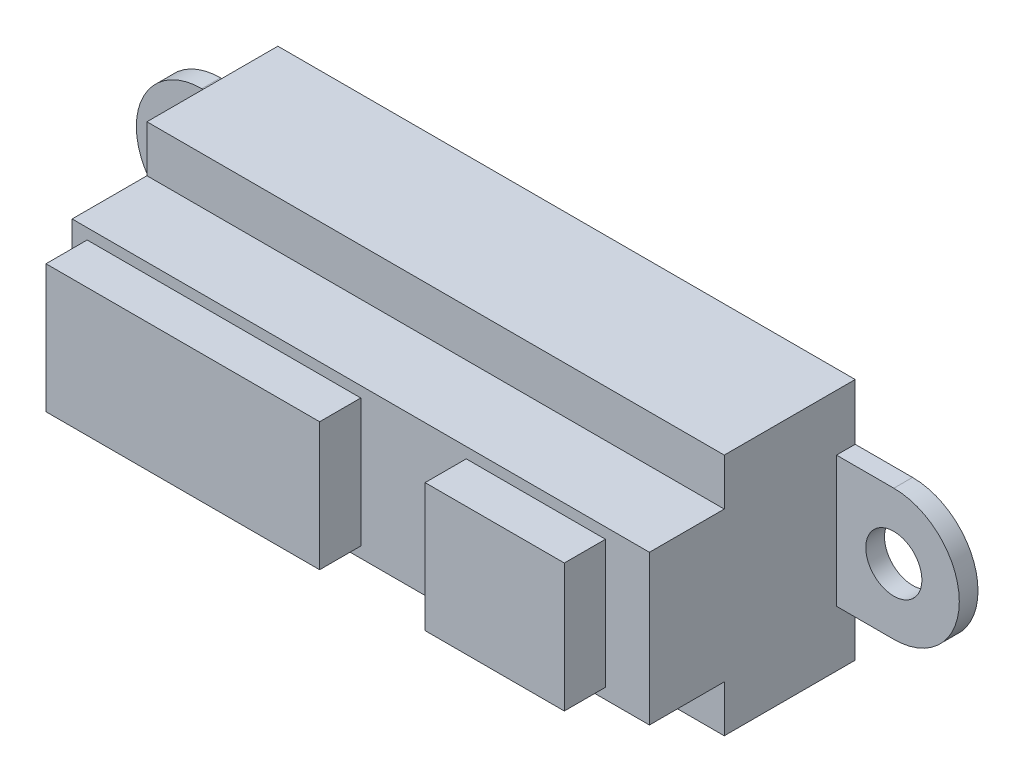
ISO-10303-21;
HEADER;
FILE_DESCRIPTION(('STEP AP214'),'2;1');
FILE_NAME('part.step','',(''),(''),'','','');
FILE_SCHEMA(('AUTOMOTIVE_DESIGN { 1 0 10303 214 1 1 1 1 }'));
ENDSEC;
DATA;
#1=APPLICATION_CONTEXT('core data for automotive mechanical design processes');
#2=APPLICATION_PROTOCOL_DEFINITION('international standard','automotive_design',2000,#1);
#3=PRODUCT_CONTEXT('',#1,'mechanical');
#4=PRODUCT('Part','Part','',(#3));
#5=PRODUCT_RELATED_PRODUCT_CATEGORY('part','',(#4));
#6=PRODUCT_DEFINITION_FORMATION('','',#4);
#7=PRODUCT_DEFINITION_CONTEXT('part definition',#1,'design');
#8=PRODUCT_DEFINITION('design','',#6,#7);
#9=PRODUCT_DEFINITION_SHAPE('','',#8);
#10=(LENGTH_UNIT() NAMED_UNIT(*) SI_UNIT(.MILLI.,.METRE.));
#11=(NAMED_UNIT(*) PLANE_ANGLE_UNIT() SI_UNIT($,.RADIAN.));
#12=(NAMED_UNIT(*) SI_UNIT($,.STERADIAN.) SOLID_ANGLE_UNIT());
#13=UNCERTAINTY_MEASURE_WITH_UNIT(LENGTH_MEASURE(1.E-05),#10,'distance_accuracy_value','');
#14=(GEOMETRIC_REPRESENTATION_CONTEXT(3) GLOBAL_UNCERTAINTY_ASSIGNED_CONTEXT((#13)) GLOBAL_UNIT_ASSIGNED_CONTEXT((#10,
#11,#12)) REPRESENTATION_CONTEXT('',''));
#15=CARTESIAN_POINT('',(0.,0.,0.));
#16=DIRECTION('',(0.,0.,1.));
#17=DIRECTION('',(1.,0.,0.));
#18=AXIS2_PLACEMENT_3D('',#15,#16,#17);
#19=CARTESIAN_POINT('',(0.,0.,11.));
#20=DIRECTION('',(0.,0.,1.));
#21=DIRECTION('',(1.,0.,0.));
#22=AXIS2_PLACEMENT_3D('',#19,#20,#21);
#23=PLANE('',#22);
#24=DIRECTION('',(0.,-1.,0.));
#25=VECTOR('',#24,1.);
#26=CARTESIAN_POINT('',(-15.4334998563258,4.,11.));
#27=LINE('',#26,#25);
#28=CARTESIAN_POINT('',(-15.4334998563258,4.,11.));
#29=VERTEX_POINT('',#28);
#30=CARTESIAN_POINT('',(-15.4334998563258,-4.,11.));
#31=VERTEX_POINT('',#30);
#32=EDGE_CURVE('E289',#29,#31,#27,.T.);
#33=ORIENTED_EDGE('',*,*,#32,.T.);
#34=DIRECTION('',(1.,0.,0.));
#35=VECTOR('',#34,1.);
#36=CARTESIAN_POINT('',(-15.4334998563258,-4.,11.));
#37=LINE('',#36,#35);
#38=CARTESIAN_POINT('',(15.4334998563258,-4.,11.));
#39=VERTEX_POINT('',#38);
#40=EDGE_CURVE('E292',#31,#39,#37,.T.);
#41=ORIENTED_EDGE('',*,*,#40,.T.);
#42=DIRECTION('',(0.,1.,0.));
#43=VECTOR('',#42,1.);
#44=CARTESIAN_POINT('',(15.4334998563258,4.,11.));
#45=LINE('',#44,#43);
#46=CARTESIAN_POINT('',(15.4334998563258,4.,11.));
#47=VERTEX_POINT('',#46);
#48=EDGE_CURVE('E294',#39,#47,#45,.T.);
#49=ORIENTED_EDGE('',*,*,#48,.T.);
#50=DIRECTION('',(-1.,0.,0.));
#51=VECTOR('',#50,1.);
#52=CARTESIAN_POINT('',(-15.4334998563258,4.,11.));
#53=LINE('',#52,#51);
#54=EDGE_CURVE('E296',#47,#29,#53,.T.);
#55=ORIENTED_EDGE('',*,*,#54,.T.);
#56=EDGE_LOOP('',(#33,#41,#49,#55));
#57=FACE_BOUND('',#56,.T.);
#58=DIRECTION('',(-1.,0.,0.));
#59=VECTOR('',#58,1.);
#60=CARTESIAN_POINT('',(0.,-3.42720985348212,11.));
#61=LINE('',#60,#59);
#62=CARTESIAN_POINT('',(0.,-3.42720985348212,11.));
#63=VERTEX_POINT('',#62);
#64=CARTESIAN_POINT('',(-14.6301323852945,-3.42720985348212,11.));
#65=VERTEX_POINT('',#64);
#66=EDGE_CURVE('E43',#63,#65,#61,.T.);
#67=ORIENTED_EDGE('',*,*,#66,.T.);
#68=DIRECTION('',(0.,1.,0.));
#69=VECTOR('',#68,1.);
#70=CARTESIAN_POINT('',(-14.6301323852945,0.,11.));
#71=LINE('',#70,#69);
#72=CARTESIAN_POINT('',(-14.6301323852945,3.42720985348204,11.));
#73=VERTEX_POINT('',#72);
#74=EDGE_CURVE('E11',#65,#73,#71,.T.);
#75=ORIENTED_EDGE('',*,*,#74,.T.);
#76=DIRECTION('',(1.,0.,0.));
#77=VECTOR('',#76,1.);
#78=CARTESIAN_POINT('',(0.,3.42720985348204,11.));
#79=LINE('',#78,#77);
#80=CARTESIAN_POINT('',(0.,3.42720985348204,11.));
#81=VERTEX_POINT('',#80);
#82=EDGE_CURVE('E377',#73,#81,#79,.T.);
#83=ORIENTED_EDGE('',*,*,#82,.T.);
#84=DIRECTION('',(0.,-1.,0.));
#85=VECTOR('',#84,1.);
#86=CARTESIAN_POINT('',(0.,0.,11.));
#87=LINE('',#86,#85);
#88=EDGE_CURVE('E380',#81,#63,#87,.T.);
#89=ORIENTED_EDGE('',*,*,#88,.T.);
#90=EDGE_LOOP('',(#67,#75,#83,#89));
#91=FACE_BOUND('',#90,.T.);
#92=DIRECTION('',(-1.,0.,0.));
#93=VECTOR('',#92,1.);
#94=CARTESIAN_POINT('',(0.,-3.42720985348212,11.));
#95=LINE('',#94,#93);
#96=CARTESIAN_POINT('',(13.0823601933993,-3.42720985348212,11.));
#97=VERTEX_POINT('',#96);
#98=CARTESIAN_POINT('',(5.63831298476084,-3.42720985348212,11.));
#99=VERTEX_POINT('',#98);
#100=EDGE_CURVE('E264',#97,#99,#95,.T.);
#101=ORIENTED_EDGE('',*,*,#100,.T.);
#102=DIRECTION('',(0.,1.,0.));
#103=VECTOR('',#102,1.);
#104=CARTESIAN_POINT('',(5.63831298476084,0.,11.));
#105=LINE('',#104,#103);
#106=CARTESIAN_POINT('',(5.63831298476084,3.42720985348204,11.));
#107=VERTEX_POINT('',#106);
#108=EDGE_CURVE('E267',#99,#107,#105,.T.);
#109=ORIENTED_EDGE('',*,*,#108,.T.);
#110=DIRECTION('',(1.,0.,0.));
#111=VECTOR('',#110,1.);
#112=CARTESIAN_POINT('',(0.,3.42720985348204,11.));
#113=LINE('',#112,#111);
#114=CARTESIAN_POINT('',(13.0823601933993,3.42720985348204,11.));
#115=VERTEX_POINT('',#114);
#116=EDGE_CURVE('E258',#107,#115,#113,.T.);
#117=ORIENTED_EDGE('',*,*,#116,.T.);
#118=DIRECTION('',(0.,-1.,0.));
#119=VECTOR('',#118,1.);
#120=CARTESIAN_POINT('',(13.0823601933993,0.,11.));
#121=LINE('',#120,#119);
#122=EDGE_CURVE('E261',#115,#97,#121,.T.);
#123=ORIENTED_EDGE('',*,*,#122,.T.);
#124=EDGE_LOOP('',(#101,#109,#117,#123));
#125=FACE_BOUND('',#124,.T.);
#126=ADVANCED_FACE('F34',(#57,#91,#125),#23,.T.);
#127=CARTESIAN_POINT('',(0.,0.,7.));
#128=DIRECTION('',(0.,0.,-1.));
#129=DIRECTION('',(-1.,0.,0.));
#130=AXIS2_PLACEMENT_3D('',#127,#128,#129);
#131=PLANE('',#130);
#132=DIRECTION('',(1.,0.,0.));
#133=VECTOR('',#132,1.);
#134=CARTESIAN_POINT('',(0.,-4.,7.));
#135=LINE('',#134,#133);
#136=CARTESIAN_POINT('',(-15.4334998563258,-4.,7.));
#137=VERTEX_POINT('',#136);
#138=CARTESIAN_POINT('',(15.4334998563258,-4.,7.));
#139=VERTEX_POINT('',#138);
#140=EDGE_CURVE('E374',#137,#139,#135,.T.);
#141=ORIENTED_EDGE('',*,*,#140,.F.);
#142=DIRECTION('',(0.,-1.,0.));
#143=VECTOR('',#142,1.);
#144=CARTESIAN_POINT('',(-15.4334998563258,6.5,7.));
#145=LINE('',#144,#143);
#146=CARTESIAN_POINT('',(-15.4334998563258,-6.5,7.));
#147=VERTEX_POINT('',#146);
#148=EDGE_CURVE('E314',#137,#147,#145,.T.);
#149=ORIENTED_EDGE('',*,*,#148,.T.);
#150=DIRECTION('',(1.,0.,0.));
#151=VECTOR('',#150,1.);
#152=CARTESIAN_POINT('',(-15.4334998563258,-6.5,7.));
#153=LINE('',#152,#151);
#154=CARTESIAN_POINT('',(15.4334998563258,-6.5,7.));
#155=VERTEX_POINT('',#154);
#156=EDGE_CURVE('E318',#147,#155,#153,.T.);
#157=ORIENTED_EDGE('',*,*,#156,.T.);
#158=DIRECTION('',(0.,1.,0.));
#159=VECTOR('',#158,1.);
#160=CARTESIAN_POINT('',(15.4334998563258,6.5,7.));
#161=LINE('',#160,#159);
#162=EDGE_CURVE('E321',#155,#139,#161,.T.);
#163=ORIENTED_EDGE('',*,*,#162,.T.);
#164=EDGE_LOOP('',(#141,#149,#157,#163));
#165=FACE_BOUND('',#164,.T.);
#166=ADVANCED_FACE('F460',(#165),#131,.F.);
#167=DIRECTION('',(-1.,0.,0.));
#168=VECTOR('',#167,1.);
#169=CARTESIAN_POINT('',(0.,4.,7.));
#170=LINE('',#169,#168);
#171=CARTESIAN_POINT('',(15.4334998563258,4.,7.));
#172=VERTEX_POINT('',#171);
#173=CARTESIAN_POINT('',(-15.4334998563258,4.,7.));
#174=VERTEX_POINT('',#173);
#175=EDGE_CURVE('E209',#172,#174,#170,.T.);
#176=ORIENTED_EDGE('',*,*,#175,.F.);
#177=CARTESIAN_POINT('',(15.4334998563258,6.5,7.));
#178=VERTEX_POINT('',#177);
#179=EDGE_CURVE('E320',#172,#178,#161,.T.);
#180=ORIENTED_EDGE('',*,*,#179,.T.);
#181=DIRECTION('',(-1.,0.,0.));
#182=VECTOR('',#181,1.);
#183=CARTESIAN_POINT('',(-15.4334998563258,6.5,7.));
#184=LINE('',#183,#182);
#185=CARTESIAN_POINT('',(-15.4334998563258,6.5,7.));
#186=VERTEX_POINT('',#185);
#187=EDGE_CURVE('E311',#178,#186,#184,.T.);
#188=ORIENTED_EDGE('',*,*,#187,.T.);
#189=EDGE_CURVE('E316',#186,#174,#145,.T.);
#190=ORIENTED_EDGE('',*,*,#189,.T.);
#191=EDGE_LOOP('',(#176,#180,#188,#190));
#192=FACE_BOUND('',#191,.T.);
#193=ADVANCED_FACE('F458',(#192),#131,.F.);
#194=CARTESIAN_POINT('',(-18.5,-3.5,1.));
#195=DIRECTION('',(0.,1.,0.));
#196=DIRECTION('',(0.,0.,1.));
#197=AXIS2_PLACEMENT_3D('',#194,#195,#196);
#198=PLANE('',#197);
#199=DIRECTION('',(0.,0.,-1.));
#200=VECTOR('',#199,1.);
#201=CARTESIAN_POINT('',(-15.4334998563258,-3.5,1.));
#202=LINE('',#201,#200);
#203=CARTESIAN_POINT('',(-15.4334998563258,-3.5,1.));
#204=VERTEX_POINT('',#203);
#205=CARTESIAN_POINT('',(-15.4334998563258,-3.49999999999999,0.));
#206=VERTEX_POINT('',#205);
#207=EDGE_CURVE('E355',#204,#206,#202,.T.);
#208=ORIENTED_EDGE('',*,*,#207,.F.);
#209=DIRECTION('',(1.,0.,0.));
#210=VECTOR('',#209,1.);
#211=CARTESIAN_POINT('',(-18.5,-3.5,1.));
#212=LINE('',#211,#210);
#213=CARTESIAN_POINT('',(-18.5,-3.5,1.));
#214=VERTEX_POINT('',#213);
#215=EDGE_CURVE('E204',#214,#204,#212,.T.);
#216=ORIENTED_EDGE('',*,*,#215,.F.);
#217=DIRECTION('',(0.,0.,-1.));
#218=VECTOR('',#217,1.);
#219=CARTESIAN_POINT('',(-18.5,-3.5,1.));
#220=LINE('',#219,#218);
#221=CARTESIAN_POINT('',(-18.5,-3.5,0.));
#222=VERTEX_POINT('',#221);
#223=EDGE_CURVE('E199',#214,#222,#220,.T.);
#224=ORIENTED_EDGE('',*,*,#223,.T.);
#225=DIRECTION('',(1.,0.,0.));
#226=VECTOR('',#225,1.);
#227=CARTESIAN_POINT('',(-18.5,-3.5,0.));
#228=LINE('',#227,#226);
#229=EDGE_CURVE('E202',#222,#206,#228,.T.);
#230=ORIENTED_EDGE('',*,*,#229,.T.);
#231=EDGE_LOOP('',(#208,#216,#224,#230));
#232=FACE_BOUND('',#231,.T.);
#233=ADVANCED_FACE('F36',(#232),#198,.F.);
#234=DIRECTION('',(0.,0.,1.));
#235=VECTOR('',#234,1.);
#236=CARTESIAN_POINT('',(15.4334998563258,-3.5,1.));
#237=LINE('',#236,#235);
#238=CARTESIAN_POINT('',(15.4334998563258,-3.49999999999999,0.));
#239=VERTEX_POINT('',#238);
#240=CARTESIAN_POINT('',(15.4334998563258,-3.5,1.));
#241=VERTEX_POINT('',#240);
#242=EDGE_CURVE('E347',#239,#241,#237,.T.);
#243=ORIENTED_EDGE('',*,*,#242,.F.);
#244=CARTESIAN_POINT('',(18.5,-3.5,0.));
#245=VERTEX_POINT('',#244);
#246=EDGE_CURVE('E221',#239,#245,#228,.T.);
#247=ORIENTED_EDGE('',*,*,#246,.T.);
#248=DIRECTION('',(0.,0.,-1.));
#249=VECTOR('',#248,1.);
#250=CARTESIAN_POINT('',(18.5,-3.5,1.));
#251=LINE('',#250,#249);
#252=CARTESIAN_POINT('',(18.5,-3.5,1.));
#253=VERTEX_POINT('',#252);
#254=EDGE_CURVE('E210',#253,#245,#251,.T.);
#255=ORIENTED_EDGE('',*,*,#254,.F.);
#256=EDGE_CURVE('E359',#241,#253,#212,.T.);
#257=ORIENTED_EDGE('',*,*,#256,.F.);
#258=EDGE_LOOP('',(#243,#247,#255,#257));
#259=FACE_BOUND('',#258,.T.);
#260=ADVANCED_FACE('F435',(#259),#198,.F.);
#261=CARTESIAN_POINT('',(-18.5,3.5,1.));
#262=DIRECTION('',(0.,-1.,0.));
#263=DIRECTION('',(0.,0.,-1.));
#264=AXIS2_PLACEMENT_3D('',#261,#262,#263);
#265=PLANE('',#264);
#266=DIRECTION('',(0.,0.,1.));
#267=VECTOR('',#266,1.);
#268=CARTESIAN_POINT('',(-15.4334998563258,3.5,1.));
#269=LINE('',#268,#267);
#270=CARTESIAN_POINT('',(-15.4334998563258,3.5,0.));
#271=VERTEX_POINT('',#270);
#272=CARTESIAN_POINT('',(-15.4334998563258,3.5,1.));
#273=VERTEX_POINT('',#272);
#274=EDGE_CURVE('E352',#271,#273,#269,.T.);
#275=ORIENTED_EDGE('',*,*,#274,.F.);
#276=DIRECTION('',(-1.,0.,0.));
#277=VECTOR('',#276,1.);
#278=CARTESIAN_POINT('',(-18.5,3.5,0.));
#279=LINE('',#278,#277);
#280=CARTESIAN_POINT('',(-18.5,3.5,0.));
#281=VERTEX_POINT('',#280);
#282=EDGE_CURVE('E220',#271,#281,#279,.T.);
#283=ORIENTED_EDGE('',*,*,#282,.T.);
#284=DIRECTION('',(0.,0.,-1.));
#285=VECTOR('',#284,1.);
#286=CARTESIAN_POINT('',(-18.5,3.5,1.));
#287=LINE('',#286,#285);
#288=CARTESIAN_POINT('',(-18.5,3.5,1.));
#289=VERTEX_POINT('',#288);
#290=EDGE_CURVE('E226',#289,#281,#287,.T.);
#291=ORIENTED_EDGE('',*,*,#290,.F.);
#292=DIRECTION('',(-1.,0.,0.));
#293=VECTOR('',#292,1.);
#294=CARTESIAN_POINT('',(-18.5,3.5,1.));
#295=LINE('',#294,#293);
#296=EDGE_CURVE('E358',#273,#289,#295,.T.);
#297=ORIENTED_EDGE('',*,*,#296,.F.);
#298=EDGE_LOOP('',(#275,#283,#291,#297));
#299=FACE_BOUND('',#298,.T.);
#300=ADVANCED_FACE('F411',(#299),#265,.F.);
#301=DIRECTION('',(0.,0.,-1.));
#302=VECTOR('',#301,1.);
#303=CARTESIAN_POINT('',(15.4334998563258,3.5,1.));
#304=LINE('',#303,#302);
#305=CARTESIAN_POINT('',(15.4334998563258,3.5,1.));
#306=VERTEX_POINT('',#305);
#307=CARTESIAN_POINT('',(15.4334998563258,3.5,0.));
#308=VERTEX_POINT('',#307);
#309=EDGE_CURVE('E345',#306,#308,#304,.T.);
#310=ORIENTED_EDGE('',*,*,#309,.F.);
#311=CARTESIAN_POINT('',(18.5,3.5,1.));
#312=VERTEX_POINT('',#311);
#313=EDGE_CURVE('E360',#312,#306,#295,.T.);
#314=ORIENTED_EDGE('',*,*,#313,.F.);
#315=DIRECTION('',(0.,0.,-1.));
#316=VECTOR('',#315,1.);
#317=CARTESIAN_POINT('',(18.5,3.5,1.));
#318=LINE('',#317,#316);
#319=CARTESIAN_POINT('',(18.5,3.5,0.));
#320=VERTEX_POINT('',#319);
#321=EDGE_CURVE('E367',#312,#320,#318,.T.);
#322=ORIENTED_EDGE('',*,*,#321,.T.);
#323=EDGE_CURVE('E363',#320,#308,#279,.T.);
#324=ORIENTED_EDGE('',*,*,#323,.T.);
#325=EDGE_LOOP('',(#310,#314,#322,#324));
#326=FACE_BOUND('',#325,.T.);
#327=ADVANCED_FACE('F404',(#326),#265,.F.);
#328=CARTESIAN_POINT('',(0.,0.,1.));
#329=DIRECTION('',(0.,0.,1.));
#330=DIRECTION('',(1.,0.,0.));
#331=AXIS2_PLACEMENT_3D('',#328,#329,#330);
#332=PLANE('',#331);
#333=CARTESIAN_POINT('',(-18.5,0.,1.));
#334=DIRECTION('',(0.,0.,1.));
#335=DIRECTION('',(1.,0.,0.));
#336=AXIS2_PLACEMENT_3D('',#333,#334,#335);
#337=CIRCLE('',#336,1.5);
#338=CARTESIAN_POINT('',(-17.,0.,1.));
#339=VERTEX_POINT('',#338);
#340=EDGE_CURVE('E392',#339,#339,#337,.T.);
#341=ORIENTED_EDGE('',*,*,#340,.F.);
#342=EDGE_LOOP('',(#341));
#343=FACE_BOUND('',#342,.T.);
#344=DIRECTION('',(0.,1.,0.));
#345=VECTOR('',#344,1.);
#346=CARTESIAN_POINT('',(-15.4334998563258,0.,1.));
#347=LINE('',#346,#345);
#348=EDGE_CURVE('E350',#204,#273,#347,.T.);
#349=ORIENTED_EDGE('',*,*,#348,.T.);
#350=ORIENTED_EDGE('',*,*,#296,.T.);
#351=CARTESIAN_POINT('',(-18.5,0.,1.));
#352=DIRECTION('',(0.,0.,1.));
#353=DIRECTION('',(1.,0.,0.));
#354=AXIS2_PLACEMENT_3D('',#351,#352,#353);
#355=CIRCLE('',#354,3.5);
#356=EDGE_CURVE('E228',#289,#214,#355,.T.);
#357=ORIENTED_EDGE('',*,*,#356,.T.);
#358=ORIENTED_EDGE('',*,*,#215,.T.);
#359=EDGE_LOOP('',(#349,#350,#357,#358));
#360=FACE_BOUND('',#359,.T.);
#361=ADVANCED_FACE('F400',(#343,#360),#332,.T.);
#362=CARTESIAN_POINT('',(18.5,0.,1.));
#363=DIRECTION('',(0.,0.,1.));
#364=DIRECTION('',(1.,0.,0.));
#365=AXIS2_PLACEMENT_3D('',#362,#363,#364);
#366=CIRCLE('',#365,1.5);
#367=CARTESIAN_POINT('',(20.,0.,1.));
#368=VERTEX_POINT('',#367);
#369=EDGE_CURVE('E385',#368,#368,#366,.T.);
#370=ORIENTED_EDGE('',*,*,#369,.F.);
#371=EDGE_LOOP('',(#370));
#372=FACE_BOUND('',#371,.T.);
#373=ORIENTED_EDGE('',*,*,#256,.T.);
#374=CARTESIAN_POINT('',(18.5,0.,1.));
#375=DIRECTION('',(0.,0.,1.));
#376=DIRECTION('',(1.,0.,0.));
#377=AXIS2_PLACEMENT_3D('',#374,#375,#376);
#378=CIRCLE('',#377,3.5);
#379=EDGE_CURVE('E227',#253,#312,#378,.T.);
#380=ORIENTED_EDGE('',*,*,#379,.T.);
#381=ORIENTED_EDGE('',*,*,#313,.T.);
#382=DIRECTION('',(0.,-1.,0.));
#383=VECTOR('',#382,1.);
#384=CARTESIAN_POINT('',(15.4334998563258,0.,1.));
#385=LINE('',#384,#383);
#386=EDGE_CURVE('E343',#306,#241,#385,.T.);
#387=ORIENTED_EDGE('',*,*,#386,.T.);
#388=EDGE_LOOP('',(#373,#380,#381,#387));
#389=FACE_BOUND('',#388,.T.);
#390=ADVANCED_FACE('F403',(#372,#389),#332,.T.);
#391=CARTESIAN_POINT('',(0.,0.,0.));
#392=DIRECTION('',(0.,0.,1.));
#393=DIRECTION('',(1.,0.,0.));
#394=AXIS2_PLACEMENT_3D('',#391,#392,#393);
#395=PLANE('',#394);
#396=CARTESIAN_POINT('',(-18.5,0.,0.));
#397=DIRECTION('',(0.,0.,1.));
#398=DIRECTION('',(1.,0.,0.));
#399=AXIS2_PLACEMENT_3D('',#396,#397,#398);
#400=CIRCLE('',#399,1.5);
#401=CARTESIAN_POINT('',(-17.,0.,0.));
#402=VERTEX_POINT('',#401);
#403=EDGE_CURVE('E38',#402,#402,#400,.T.);
#404=ORIENTED_EDGE('',*,*,#403,.T.);
#405=EDGE_LOOP('',(#404));
#406=FACE_BOUND('',#405,.T.);
#407=CARTESIAN_POINT('',(18.5,0.,0.));
#408=DIRECTION('',(0.,0.,1.));
#409=DIRECTION('',(1.,0.,0.));
#410=AXIS2_PLACEMENT_3D('',#407,#408,#409);
#411=CIRCLE('',#410,1.5);
#412=CARTESIAN_POINT('',(20.,0.,0.));
#413=VERTEX_POINT('',#412);
#414=EDGE_CURVE('E233',#413,#413,#411,.T.);
#415=ORIENTED_EDGE('',*,*,#414,.T.);
#416=EDGE_LOOP('',(#415));
#417=FACE_BOUND('',#416,.T.);
#418=ORIENTED_EDGE('',*,*,#229,.F.);
#419=CARTESIAN_POINT('',(-18.5,0.,0.));
#420=DIRECTION('',(0.,0.,1.));
#421=DIRECTION('',(1.,0.,0.));
#422=AXIS2_PLACEMENT_3D('',#419,#420,#421);
#423=CIRCLE('',#422,3.5);
#424=EDGE_CURVE('E217',#222,#281,#423,.F.);
#425=ORIENTED_EDGE('',*,*,#424,.T.);
#426=ORIENTED_EDGE('',*,*,#282,.F.);
#427=DIRECTION('',(0.,-1.,0.));
#428=VECTOR('',#427,1.);
#429=CARTESIAN_POINT('',(-15.4334998563258,6.5,0.));
#430=LINE('',#429,#428);
#431=CARTESIAN_POINT('',(-15.4334998563258,6.5,0.));
#432=VERTEX_POINT('',#431);
#433=EDGE_CURVE('E326',#432,#271,#430,.T.);
#434=ORIENTED_EDGE('',*,*,#433,.F.);
#435=DIRECTION('',(-1.,0.,0.));
#436=VECTOR('',#435,1.);
#437=CARTESIAN_POINT('',(-15.4334998563258,6.5,0.));
#438=LINE('',#437,#436);
#439=CARTESIAN_POINT('',(15.4334998563258,6.5,0.));
#440=VERTEX_POINT('',#439);
#441=EDGE_CURVE('E310',#440,#432,#438,.T.);
#442=ORIENTED_EDGE('',*,*,#441,.F.);
#443=DIRECTION('',(0.,1.,0.));
#444=VECTOR('',#443,1.);
#445=CARTESIAN_POINT('',(15.4334998563258,6.5,0.));
#446=LINE('',#445,#444);
#447=EDGE_CURVE('E330',#308,#440,#446,.T.);
#448=ORIENTED_EDGE('',*,*,#447,.F.);
#449=ORIENTED_EDGE('',*,*,#323,.F.);
#450=CARTESIAN_POINT('',(18.5,0.,0.));
#451=DIRECTION('',(0.,0.,1.));
#452=DIRECTION('',(1.,0.,0.));
#453=AXIS2_PLACEMENT_3D('',#450,#451,#452);
#454=CIRCLE('',#453,3.5);
#455=EDGE_CURVE('E231',#320,#245,#454,.F.);
#456=ORIENTED_EDGE('',*,*,#455,.T.);
#457=ORIENTED_EDGE('',*,*,#246,.F.);
#458=CARTESIAN_POINT('',(15.4334998563258,-6.5,0.));
#459=VERTEX_POINT('',#458);
#460=EDGE_CURVE('E315',#459,#239,#446,.T.);
#461=ORIENTED_EDGE('',*,*,#460,.F.);
#462=DIRECTION('',(1.,0.,0.));
#463=VECTOR('',#462,1.);
#464=CARTESIAN_POINT('',(-15.4334998563258,-6.5,0.));
#465=LINE('',#464,#463);
#466=CARTESIAN_POINT('',(-15.4334998563258,-6.5,0.));
#467=VERTEX_POINT('',#466);
#468=EDGE_CURVE('E328',#467,#459,#465,.T.);
#469=ORIENTED_EDGE('',*,*,#468,.F.);
#470=EDGE_CURVE('E219',#206,#467,#430,.T.);
#471=ORIENTED_EDGE('',*,*,#470,.F.);
#472=EDGE_LOOP('',(#418,#425,#426,#434,#442,#448,#449,#456,#457,#461,#469,#471));
#473=FACE_BOUND('',#472,.T.);
#474=ADVANCED_FACE('F215',(#406,#417,#473),#395,.F.);
#475=CARTESIAN_POINT('',(-15.4334998563258,6.5,7.));
#476=DIRECTION('',(1.,0.,0.));
#477=DIRECTION('',(0.,0.,-1.));
#478=AXIS2_PLACEMENT_3D('',#475,#476,#477);
#479=PLANE('',#478);
#480=ORIENTED_EDGE('',*,*,#470,.T.);
#481=DIRECTION('',(0.,0.,-1.));
#482=VECTOR('',#481,1.);
#483=CARTESIAN_POINT('',(-15.4334998563258,-6.5,7.));
#484=LINE('',#483,#482);
#485=EDGE_CURVE('E337',#147,#467,#484,.T.);
#486=ORIENTED_EDGE('',*,*,#485,.F.);
#487=ORIENTED_EDGE('',*,*,#148,.F.);
#488=DIRECTION('',(0.,0.,-1.));
#489=VECTOR('',#488,1.);
#490=CARTESIAN_POINT('',(-15.4334998563258,-4.,11.));
#491=LINE('',#490,#489);
#492=EDGE_CURVE('E307',#31,#137,#491,.T.);
#493=ORIENTED_EDGE('',*,*,#492,.F.);
#494=ORIENTED_EDGE('',*,*,#32,.F.);
#495=DIRECTION('',(0.,0.,-1.));
#496=VECTOR('',#495,1.);
#497=CARTESIAN_POINT('',(-15.4334998563258,4.,11.));
#498=LINE('',#497,#496);
#499=EDGE_CURVE('E298',#29,#174,#498,.T.);
#500=ORIENTED_EDGE('',*,*,#499,.T.);
#501=ORIENTED_EDGE('',*,*,#189,.F.);
#502=DIRECTION('',(0.,0.,-1.));
#503=VECTOR('',#502,1.);
#504=CARTESIAN_POINT('',(-15.4334998563258,6.5,7.));
#505=LINE('',#504,#503);
#506=EDGE_CURVE('E340',#186,#432,#505,.T.);
#507=ORIENTED_EDGE('',*,*,#506,.T.);
#508=ORIENTED_EDGE('',*,*,#433,.T.);
#509=ORIENTED_EDGE('',*,*,#274,.T.);
#510=ORIENTED_EDGE('',*,*,#348,.F.);
#511=ORIENTED_EDGE('',*,*,#207,.T.);
#512=EDGE_LOOP('',(#480,#486,#487,#493,#494,#500,#501,#507,#508,#509,#510,#511));
#513=FACE_BOUND('',#512,.T.);
#514=ADVANCED_FACE('F409',(#513),#479,.F.);
#515=CARTESIAN_POINT('',(15.4334998563258,6.5,7.));
#516=DIRECTION('',(-1.,0.,0.));
#517=DIRECTION('',(0.,0.,1.));
#518=AXIS2_PLACEMENT_3D('',#515,#516,#517);
#519=PLANE('',#518);
#520=ORIENTED_EDGE('',*,*,#447,.T.);
#521=DIRECTION('',(0.,0.,-1.));
#522=VECTOR('',#521,1.);
#523=CARTESIAN_POINT('',(15.4334998563258,6.5,7.));
#524=LINE('',#523,#522);
#525=EDGE_CURVE('E323',#178,#440,#524,.T.);
#526=ORIENTED_EDGE('',*,*,#525,.F.);
#527=ORIENTED_EDGE('',*,*,#179,.F.);
#528=DIRECTION('',(0.,0.,-1.));
#529=VECTOR('',#528,1.);
#530=CARTESIAN_POINT('',(15.4334998563258,4.,11.));
#531=LINE('',#530,#529);
#532=EDGE_CURVE('E301',#47,#172,#531,.T.);
#533=ORIENTED_EDGE('',*,*,#532,.F.);
#534=ORIENTED_EDGE('',*,*,#48,.F.);
#535=DIRECTION('',(0.,0.,-1.));
#536=VECTOR('',#535,1.);
#537=CARTESIAN_POINT('',(15.4334998563258,-4.,11.));
#538=LINE('',#537,#536);
#539=EDGE_CURVE('E304',#39,#139,#538,.T.);
#540=ORIENTED_EDGE('',*,*,#539,.T.);
#541=ORIENTED_EDGE('',*,*,#162,.F.);
#542=DIRECTION('',(0.,0.,-1.));
#543=VECTOR('',#542,1.);
#544=CARTESIAN_POINT('',(15.4334998563258,-6.5,7.));
#545=LINE('',#544,#543);
#546=EDGE_CURVE('E334',#155,#459,#545,.T.);
#547=ORIENTED_EDGE('',*,*,#546,.T.);
#548=ORIENTED_EDGE('',*,*,#460,.T.);
#549=ORIENTED_EDGE('',*,*,#242,.T.);
#550=ORIENTED_EDGE('',*,*,#386,.F.);
#551=ORIENTED_EDGE('',*,*,#309,.T.);
#552=EDGE_LOOP('',(#520,#526,#527,#533,#534,#540,#541,#547,#548,#549,#550,#551));
#553=FACE_BOUND('',#552,.T.);
#554=ADVANCED_FACE('F421',(#553),#519,.F.);
#555=CARTESIAN_POINT('',(-15.4334998563258,6.5,7.));
#556=DIRECTION('',(0.,-1.,0.));
#557=DIRECTION('',(1.,0.,0.));
#558=AXIS2_PLACEMENT_3D('',#555,#556,#557);
#559=PLANE('',#558);
#560=ORIENTED_EDGE('',*,*,#441,.T.);
#561=ORIENTED_EDGE('',*,*,#506,.F.);
#562=ORIENTED_EDGE('',*,*,#187,.F.);
#563=ORIENTED_EDGE('',*,*,#525,.T.);
#564=EDGE_LOOP('',(#560,#561,#562,#563));
#565=FACE_BOUND('',#564,.T.);
#566=ADVANCED_FACE('F417',(#565),#559,.F.);
#567=CARTESIAN_POINT('',(-15.4334998563258,-6.5,7.));
#568=DIRECTION('',(0.,1.,0.));
#569=DIRECTION('',(-1.,0.,0.));
#570=AXIS2_PLACEMENT_3D('',#567,#568,#569);
#571=PLANE('',#570);
#572=ORIENTED_EDGE('',*,*,#468,.T.);
#573=ORIENTED_EDGE('',*,*,#546,.F.);
#574=ORIENTED_EDGE('',*,*,#156,.F.);
#575=ORIENTED_EDGE('',*,*,#485,.T.);
#576=EDGE_LOOP('',(#572,#573,#574,#575));
#577=FACE_BOUND('',#576,.T.);
#578=ADVANCED_FACE('F441',(#577),#571,.F.);
#579=CARTESIAN_POINT('',(-15.4334998563258,-4.,11.));
#580=DIRECTION('',(0.,1.,0.));
#581=DIRECTION('',(0.,0.,1.));
#582=AXIS2_PLACEMENT_3D('',#579,#580,#581);
#583=PLANE('',#582);
#584=ORIENTED_EDGE('',*,*,#492,.T.);
#585=ORIENTED_EDGE('',*,*,#140,.T.);
#586=ORIENTED_EDGE('',*,*,#539,.F.);
#587=ORIENTED_EDGE('',*,*,#40,.F.);
#588=EDGE_LOOP('',(#584,#585,#586,#587));
#589=FACE_BOUND('',#588,.T.);
#590=ADVANCED_FACE('F448',(#589),#583,.F.);
#591=CARTESIAN_POINT('',(-15.4334998563258,4.,11.));
#592=DIRECTION('',(0.,-1.,0.));
#593=DIRECTION('',(0.,0.,-1.));
#594=AXIS2_PLACEMENT_3D('',#591,#592,#593);
#595=PLANE('',#594);
#596=ORIENTED_EDGE('',*,*,#532,.T.);
#597=ORIENTED_EDGE('',*,*,#175,.T.);
#598=ORIENTED_EDGE('',*,*,#499,.F.);
#599=ORIENTED_EDGE('',*,*,#54,.F.);
#600=EDGE_LOOP('',(#596,#597,#598,#599));
#601=FACE_BOUND('',#600,.T.);
#602=ADVANCED_FACE('F456',(#601),#595,.F.);
#603=CARTESIAN_POINT('',(-14.6301323852945,3.42720985348204,13.2));
#604=DIRECTION('',(1.,0.,0.));
#605=DIRECTION('',(0.,0.,-1.));
#606=AXIS2_PLACEMENT_3D('',#603,#604,#605);
#607=PLANE('',#606);
#608=ORIENTED_EDGE('',*,*,#74,.F.);
#609=DIRECTION('',(0.,0.,-1.));
#610=VECTOR('',#609,1.);
#611=CARTESIAN_POINT('',(-14.6301323852945,-3.42720985348212,13.2));
#612=LINE('',#611,#610);
#613=CARTESIAN_POINT('',(-14.6301323852945,-3.42720985348212,13.2));
#614=VERTEX_POINT('',#613);
#615=EDGE_CURVE('E286',#614,#65,#612,.T.);
#616=ORIENTED_EDGE('',*,*,#615,.F.);
#617=DIRECTION('',(0.,-1.,0.));
#618=VECTOR('',#617,1.);
#619=CARTESIAN_POINT('',(-14.6301323852945,3.42720985348204,13.2));
#620=LINE('',#619,#618);
#621=CARTESIAN_POINT('',(-14.6301323852945,3.42720985348204,13.2));
#622=VERTEX_POINT('',#621);
#623=EDGE_CURVE('E270',#622,#614,#620,.T.);
#624=ORIENTED_EDGE('',*,*,#623,.F.);
#625=DIRECTION('',(0.,0.,-1.));
#626=VECTOR('',#625,1.);
#627=CARTESIAN_POINT('',(-14.6301323852945,3.42720985348204,13.2));
#628=LINE('',#627,#626);
#629=EDGE_CURVE('E279',#622,#73,#628,.T.);
#630=ORIENTED_EDGE('',*,*,#629,.T.);
#631=EDGE_LOOP('',(#608,#616,#624,#630));
#632=FACE_BOUND('',#631,.T.);
#633=ADVANCED_FACE('F474',(#632),#607,.F.);
#634=CARTESIAN_POINT('',(-14.6301323852945,-3.42720985348212,13.2));
#635=DIRECTION('',(0.,1.,0.));
#636=DIRECTION('',(0.,0.,1.));
#637=AXIS2_PLACEMENT_3D('',#634,#635,#636);
#638=PLANE('',#637);
#639=ORIENTED_EDGE('',*,*,#66,.F.);
#640=DIRECTION('',(0.,0.,-1.));
#641=VECTOR('',#640,1.);
#642=CARTESIAN_POINT('',(0.,-3.42720985348212,13.2));
#643=LINE('',#642,#641);
#644=CARTESIAN_POINT('',(0.,-3.42720985348212,13.2));
#645=VERTEX_POINT('',#644);
#646=EDGE_CURVE('E283',#645,#63,#643,.T.);
#647=ORIENTED_EDGE('',*,*,#646,.F.);
#648=DIRECTION('',(1.,0.,0.));
#649=VECTOR('',#648,1.);
#650=CARTESIAN_POINT('',(-14.6301323852945,-3.42720985348212,13.2));
#651=LINE('',#650,#649);
#652=EDGE_CURVE('E273',#614,#645,#651,.T.);
#653=ORIENTED_EDGE('',*,*,#652,.F.);
#654=ORIENTED_EDGE('',*,*,#615,.T.);
#655=EDGE_LOOP('',(#639,#647,#653,#654));
#656=FACE_BOUND('',#655,.T.);
#657=ADVANCED_FACE('F583',(#656),#638,.F.);
#658=CARTESIAN_POINT('',(0.,3.42720985348204,13.2));
#659=DIRECTION('',(-1.,0.,0.));
#660=DIRECTION('',(0.,0.,1.));
#661=AXIS2_PLACEMENT_3D('',#658,#659,#660);
#662=PLANE('',#661);
#663=ORIENTED_EDGE('',*,*,#88,.F.);
#664=DIRECTION('',(0.,0.,-1.));
#665=VECTOR('',#664,1.);
#666=CARTESIAN_POINT('',(0.,3.42720985348204,13.2));
#667=LINE('',#666,#665);
#668=CARTESIAN_POINT('',(0.,3.42720985348204,13.2));
#669=VERTEX_POINT('',#668);
#670=EDGE_CURVE('E59',#669,#81,#667,.T.);
#671=ORIENTED_EDGE('',*,*,#670,.F.);
#672=DIRECTION('',(0.,1.,0.));
#673=VECTOR('',#672,1.);
#674=CARTESIAN_POINT('',(0.,3.42720985348204,13.2));
#675=LINE('',#674,#673);
#676=EDGE_CURVE('E275',#645,#669,#675,.T.);
#677=ORIENTED_EDGE('',*,*,#676,.F.);
#678=ORIENTED_EDGE('',*,*,#646,.T.);
#679=EDGE_LOOP('',(#663,#671,#677,#678));
#680=FACE_BOUND('',#679,.T.);
#681=ADVANCED_FACE('F574',(#680),#662,.F.);
#682=CARTESIAN_POINT('',(-14.6301323852945,3.42720985348204,13.2));
#683=DIRECTION('',(0.,-1.,0.));
#684=DIRECTION('',(0.,0.,-1.));
#685=AXIS2_PLACEMENT_3D('',#682,#683,#684);
#686=PLANE('',#685);
#687=ORIENTED_EDGE('',*,*,#82,.F.);
#688=ORIENTED_EDGE('',*,*,#629,.F.);
#689=DIRECTION('',(-1.,0.,0.));
#690=VECTOR('',#689,1.);
#691=CARTESIAN_POINT('',(-14.6301323852945,3.42720985348204,13.2));
#692=LINE('',#691,#690);
#693=EDGE_CURVE('E277',#669,#622,#692,.T.);
#694=ORIENTED_EDGE('',*,*,#693,.F.);
#695=ORIENTED_EDGE('',*,*,#670,.T.);
#696=EDGE_LOOP('',(#687,#688,#694,#695));
#697=FACE_BOUND('',#696,.T.);
#698=ADVANCED_FACE('F564',(#697),#686,.F.);
#699=CARTESIAN_POINT('',(0.,0.,13.2));
#700=DIRECTION('',(0.,0.,1.));
#701=DIRECTION('',(1.,0.,0.));
#702=AXIS2_PLACEMENT_3D('',#699,#700,#701);
#703=PLANE('',#702);
#704=ORIENTED_EDGE('',*,*,#623,.T.);
#705=ORIENTED_EDGE('',*,*,#652,.T.);
#706=ORIENTED_EDGE('',*,*,#676,.T.);
#707=ORIENTED_EDGE('',*,*,#693,.T.);
#708=EDGE_LOOP('',(#704,#705,#706,#707));
#709=FACE_BOUND('',#708,.T.);
#710=ADVANCED_FACE('F554',(#709),#703,.T.);
#711=CARTESIAN_POINT('',(5.63831298476084,3.42720985348204,13.2));
#712=DIRECTION('',(1.,0.,0.));
#713=DIRECTION('',(0.,1.,0.));
#714=AXIS2_PLACEMENT_3D('',#711,#712,#713);
#715=PLANE('',#714);
#716=ORIENTED_EDGE('',*,*,#108,.F.);
#717=DIRECTION('',(0.,0.,-1.));
#718=VECTOR('',#717,1.);
#719=CARTESIAN_POINT('',(5.63831298476084,-3.42720985348212,13.2));
#720=LINE('',#719,#718);
#721=CARTESIAN_POINT('',(5.63831298476084,-3.42720985348212,13.2));
#722=VERTEX_POINT('',#721);
#723=EDGE_CURVE('E255',#722,#99,#720,.T.);
#724=ORIENTED_EDGE('',*,*,#723,.F.);
#725=DIRECTION('',(0.,-1.,0.));
#726=VECTOR('',#725,1.);
#727=CARTESIAN_POINT('',(5.63831298476084,3.42720985348204,13.2));
#728=LINE('',#727,#726);
#729=CARTESIAN_POINT('',(5.63831298476084,3.42720985348204,13.2));
#730=VERTEX_POINT('',#729);
#731=EDGE_CURVE('E239',#730,#722,#728,.T.);
#732=ORIENTED_EDGE('',*,*,#731,.F.);
#733=DIRECTION('',(0.,0.,-1.));
#734=VECTOR('',#733,1.);
#735=CARTESIAN_POINT('',(5.63831298476084,3.42720985348204,13.2));
#736=LINE('',#735,#734);
#737=EDGE_CURVE('E248',#730,#107,#736,.T.);
#738=ORIENTED_EDGE('',*,*,#737,.T.);
#739=EDGE_LOOP('',(#716,#724,#732,#738));
#740=FACE_BOUND('',#739,.T.);
#741=ADVANCED_FACE('F544',(#740),#715,.F.);
#742=CARTESIAN_POINT('',(5.63831298476084,-3.42720985348212,13.2));
#743=DIRECTION('',(0.,1.,0.));
#744=DIRECTION('',(0.,0.,1.));
#745=AXIS2_PLACEMENT_3D('',#742,#743,#744);
#746=PLANE('',#745);
#747=ORIENTED_EDGE('',*,*,#100,.F.);
#748=DIRECTION('',(0.,0.,-1.));
#749=VECTOR('',#748,1.);
#750=CARTESIAN_POINT('',(13.0823601933993,-3.42720985348212,13.2));
#751=LINE('',#750,#749);
#752=CARTESIAN_POINT('',(13.0823601933993,-3.42720985348212,13.2));
#753=VERTEX_POINT('',#752);
#754=EDGE_CURVE('E252',#753,#97,#751,.T.);
#755=ORIENTED_EDGE('',*,*,#754,.F.);
#756=DIRECTION('',(1.,0.,0.));
#757=VECTOR('',#756,1.);
#758=CARTESIAN_POINT('',(5.63831298476084,-3.42720985348212,13.2));
#759=LINE('',#758,#757);
#760=EDGE_CURVE('E242',#722,#753,#759,.T.);
#761=ORIENTED_EDGE('',*,*,#760,.F.);
#762=ORIENTED_EDGE('',*,*,#723,.T.);
#763=EDGE_LOOP('',(#747,#755,#761,#762));
#764=FACE_BOUND('',#763,.T.);
#765=ADVANCED_FACE('F534',(#764),#746,.F.);
#766=CARTESIAN_POINT('',(13.0823601933993,3.42720985348204,13.2));
#767=DIRECTION('',(-1.,0.,0.));
#768=DIRECTION('',(0.,0.,1.));
#769=AXIS2_PLACEMENT_3D('',#766,#767,#768);
#770=PLANE('',#769);
#771=ORIENTED_EDGE('',*,*,#122,.F.);
#772=DIRECTION('',(0.,0.,-1.));
#773=VECTOR('',#772,1.);
#774=CARTESIAN_POINT('',(13.0823601933993,3.42720985348204,13.2));
#775=LINE('',#774,#773);
#776=CARTESIAN_POINT('',(13.0823601933993,3.42720985348204,13.2));
#777=VERTEX_POINT('',#776);
#778=EDGE_CURVE('E51',#777,#115,#775,.T.);
#779=ORIENTED_EDGE('',*,*,#778,.F.);
#780=DIRECTION('',(0.,1.,0.));
#781=VECTOR('',#780,1.);
#782=CARTESIAN_POINT('',(13.0823601933993,3.42720985348204,13.2));
#783=LINE('',#782,#781);
#784=EDGE_CURVE('E244',#753,#777,#783,.T.);
#785=ORIENTED_EDGE('',*,*,#784,.F.);
#786=ORIENTED_EDGE('',*,*,#754,.T.);
#787=EDGE_LOOP('',(#771,#779,#785,#786));
#788=FACE_BOUND('',#787,.T.);
#789=ADVANCED_FACE('F525',(#788),#770,.F.);
#790=CARTESIAN_POINT('',(5.63831298476084,3.42720985348204,13.2));
#791=DIRECTION('',(0.,-1.,0.));
#792=DIRECTION('',(0.,0.,-1.));
#793=AXIS2_PLACEMENT_3D('',#790,#791,#792);
#794=PLANE('',#793);
#795=ORIENTED_EDGE('',*,*,#116,.F.);
#796=ORIENTED_EDGE('',*,*,#737,.F.);
#797=DIRECTION('',(-1.,0.,0.));
#798=VECTOR('',#797,1.);
#799=CARTESIAN_POINT('',(5.63831298476084,3.42720985348204,13.2));
#800=LINE('',#799,#798);
#801=EDGE_CURVE('E246',#777,#730,#800,.T.);
#802=ORIENTED_EDGE('',*,*,#801,.F.);
#803=ORIENTED_EDGE('',*,*,#778,.T.);
#804=EDGE_LOOP('',(#795,#796,#802,#803));
#805=FACE_BOUND('',#804,.T.);
#806=ADVANCED_FACE('F513',(#805),#794,.F.);
#807=CARTESIAN_POINT('',(0.,0.,13.2));
#808=DIRECTION('',(0.,0.,1.));
#809=DIRECTION('',(1.,0.,0.));
#810=AXIS2_PLACEMENT_3D('',#807,#808,#809);
#811=PLANE('',#810);
#812=ORIENTED_EDGE('',*,*,#731,.T.);
#813=ORIENTED_EDGE('',*,*,#760,.T.);
#814=ORIENTED_EDGE('',*,*,#784,.T.);
#815=ORIENTED_EDGE('',*,*,#801,.T.);
#816=EDGE_LOOP('',(#812,#813,#814,#815));
#817=FACE_BOUND('',#816,.T.);
#818=ADVANCED_FACE('F508',(#817),#811,.T.);
#819=CARTESIAN_POINT('',(18.5,0.,-9.89949493661167));
#820=DIRECTION('',(0.,0.,1.));
#821=DIRECTION('',(1.,0.,0.));
#822=AXIS2_PLACEMENT_3D('',#819,#820,#821);
#823=CYLINDRICAL_SURFACE('',#822,3.5);
#824=ORIENTED_EDGE('',*,*,#254,.T.);
#825=ORIENTED_EDGE('',*,*,#455,.F.);
#826=ORIENTED_EDGE('',*,*,#321,.F.);
#827=ORIENTED_EDGE('',*,*,#379,.F.);
#828=EDGE_LOOP('',(#824,#825,#826,#827));
#829=FACE_BOUND('',#828,.T.);
#830=ADVANCED_FACE('F429',(#829),#823,.T.);
#831=CARTESIAN_POINT('',(-18.5,0.,-9.89949493661167));
#832=DIRECTION('',(0.,0.,1.));
#833=DIRECTION('',(1.,0.,0.));
#834=AXIS2_PLACEMENT_3D('',#831,#832,#833);
#835=CYLINDRICAL_SURFACE('',#834,3.5);
#836=ORIENTED_EDGE('',*,*,#290,.T.);
#837=ORIENTED_EDGE('',*,*,#424,.F.);
#838=ORIENTED_EDGE('',*,*,#223,.F.);
#839=ORIENTED_EDGE('',*,*,#356,.F.);
#840=EDGE_LOOP('',(#836,#837,#838,#839));
#841=FACE_BOUND('',#840,.T.);
#842=ADVANCED_FACE('F224',(#841),#835,.T.);
#843=CARTESIAN_POINT('',(18.5,0.,1.));
#844=DIRECTION('',(0.,0.,1.));
#845=DIRECTION('',(1.,0.,0.));
#846=AXIS2_PLACEMENT_3D('',#843,#844,#845);
#847=CYLINDRICAL_SURFACE('',#846,1.5);
#848=ORIENTED_EDGE('',*,*,#369,.T.);
#849=EDGE_LOOP('',(#848));
#850=FACE_BOUND('',#849,.T.);
#851=ORIENTED_EDGE('',*,*,#414,.F.);
#852=EDGE_LOOP('',(#851));
#853=FACE_BOUND('',#852,.T.);
#854=ADVANCED_FACE('F715',(#850,#853),#847,.F.);
#855=CARTESIAN_POINT('',(-18.5,0.,1.));
#856=DIRECTION('',(0.,0.,1.));
#857=DIRECTION('',(1.,0.,0.));
#858=AXIS2_PLACEMENT_3D('',#855,#856,#857);
#859=CYLINDRICAL_SURFACE('',#858,1.5);
#860=ORIENTED_EDGE('',*,*,#340,.T.);
#861=EDGE_LOOP('',(#860));
#862=FACE_BOUND('',#861,.T.);
#863=ORIENTED_EDGE('',*,*,#403,.F.);
#864=EDGE_LOOP('',(#863));
#865=FACE_BOUND('',#864,.T.);
#866=ADVANCED_FACE('F397',(#862,#865),#859,.F.);
#867=CLOSED_SHELL('',(#126,#166,#193,#233,#260,#300,#327,#361,#390,#474,#514,#554,#566,#578,
#590,#602,#633,#657,#681,#698,#710,#741,#765,#789,#806,#818,#830,#842,#854,#866));
#868=MANIFOLD_SOLID_BREP('B2',#867);
#869=ADVANCED_BREP_SHAPE_REPRESENTATION('',(#18,#868),#14);
#870=SHAPE_DEFINITION_REPRESENTATION(#9,#869);
ENDSEC;
END-ISO-10303-21;
